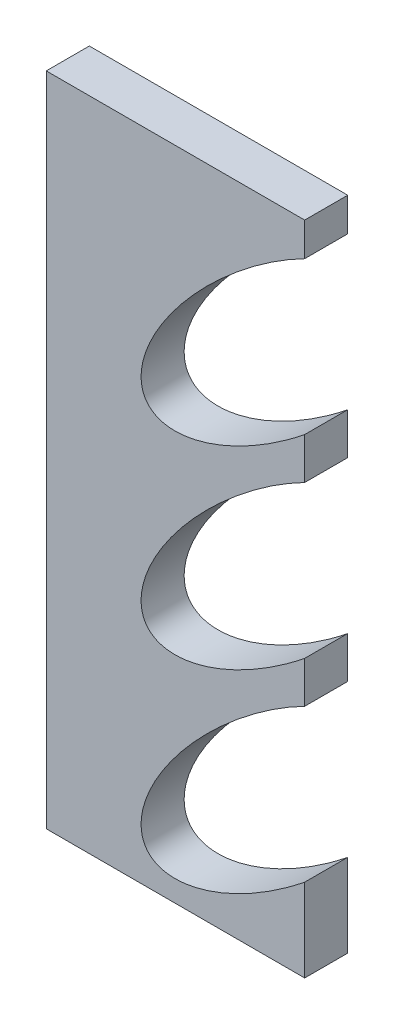
ISO-10303-21;
HEADER;
FILE_DESCRIPTION(('STEP AP214'),'2;1');
FILE_NAME('part.step','',(''),(''),'','','');
FILE_SCHEMA(('AUTOMOTIVE_DESIGN { 1 0 10303 214 1 1 1 1 }'));
ENDSEC;
DATA;
#1=APPLICATION_CONTEXT('core data for automotive mechanical design processes');
#2=APPLICATION_PROTOCOL_DEFINITION('international standard','automotive_design',2000,#1);
#3=PRODUCT_CONTEXT('',#1,'mechanical');
#4=PRODUCT('Part','Part','',(#3));
#5=PRODUCT_RELATED_PRODUCT_CATEGORY('part','',(#4));
#6=PRODUCT_DEFINITION_FORMATION('','',#4);
#7=PRODUCT_DEFINITION_CONTEXT('part definition',#1,'design');
#8=PRODUCT_DEFINITION('design','',#6,#7);
#9=PRODUCT_DEFINITION_SHAPE('','',#8);
#10=(LENGTH_UNIT() NAMED_UNIT(*) SI_UNIT(.MILLI.,.METRE.));
#11=(NAMED_UNIT(*) PLANE_ANGLE_UNIT() SI_UNIT($,.RADIAN.));
#12=(NAMED_UNIT(*) SI_UNIT($,.STERADIAN.) SOLID_ANGLE_UNIT());
#13=UNCERTAINTY_MEASURE_WITH_UNIT(LENGTH_MEASURE(1.E-05),#10,'distance_accuracy_value','');
#14=(GEOMETRIC_REPRESENTATION_CONTEXT(3) GLOBAL_UNCERTAINTY_ASSIGNED_CONTEXT((#13)) GLOBAL_UNIT_ASSIGNED_CONTEXT((#10,
#11,#12)) REPRESENTATION_CONTEXT('',''));
#15=CARTESIAN_POINT('',(0.,0.,0.));
#16=DIRECTION('',(0.,0.,1.));
#17=DIRECTION('',(1.,0.,0.));
#18=AXIS2_PLACEMENT_3D('',#15,#16,#17);
#19=CARTESIAN_POINT('',(11.560233287585,-74.854986086369,10.));
#20=DIRECTION('',(0.,0.,1.));
#21=DIRECTION('',(0.761644612027726,0.647994972950513,0.));
#22=AXIS2_PLACEMENT_3D('',#19,#20,#21);
#23=ELLIPSE('',#22,38.2784229302773,14.5789494724015);
#24=DIRECTION('',(0.,0.,-1.));
#25=VECTOR('',#24,1.);
#26=SURFACE_OF_LINEAR_EXTRUSION('',#23,#25);
#27=CARTESIAN_POINT('',(11.560233287585,-74.854986086369,0.));
#28=DIRECTION('',(0.,0.,1.));
#29=DIRECTION('',(0.761644612027726,0.647994972950513,0.));
#30=AXIS2_PLACEMENT_3D('',#27,#28,#29);
#31=ELLIPSE('',#30,38.2784229302773,14.5789494724015);
#32=CARTESIAN_POINT('',(18.897322572362,-52.3455624513533,0.));
#33=VERTEX_POINT('',#32);
#34=CARTESIAN_POINT('',(18.897322572362,-87.7050667853162,0.));
#35=VERTEX_POINT('',#34);
#36=EDGE_CURVE('E147',#33,#35,#31,.T.);
#37=ORIENTED_EDGE('',*,*,#36,.F.);
#38=DIRECTION('',(0.,0.,-1.));
#39=VECTOR('',#38,1.);
#40=CARTESIAN_POINT('',(18.897322572362,-52.3455624513533,10.));
#41=LINE('',#40,#39);
#42=CARTESIAN_POINT('',(18.897322572362,-52.3455624513533,10.));
#43=VERTEX_POINT('',#42);
#44=EDGE_CURVE('E11',#43,#33,#41,.T.);
#45=ORIENTED_EDGE('',*,*,#44,.F.);
#46=CARTESIAN_POINT('',(18.897322572362,-87.7050667853162,10.));
#47=VERTEX_POINT('',#46);
#48=EDGE_CURVE('E197',#43,#47,#23,.T.);
#49=ORIENTED_EDGE('',*,*,#48,.T.);
#50=DIRECTION('',(0.,0.,-1.));
#51=VECTOR('',#50,1.);
#52=CARTESIAN_POINT('',(18.897322572362,-87.7050667853162,10.));
#53=LINE('',#52,#51);
#54=EDGE_CURVE('E56',#47,#35,#53,.T.);
#55=ORIENTED_EDGE('',*,*,#54,.T.);
#56=EDGE_LOOP('',(#37,#45,#49,#55));
#57=FACE_BOUND('',#56,.T.);
#58=ADVANCED_FACE('F39',(#57),#26,.T.);
#59=CARTESIAN_POINT('',(18.8973225723619,0.,10.));
#60=DIRECTION('',(1.,0.,0.));
#61=DIRECTION('',(0.,1.,0.));
#62=AXIS2_PLACEMENT_3D('',#59,#60,#61);
#63=PLANE('',#62);
#64=DIRECTION('',(0.,-1.,0.));
#65=VECTOR('',#64,1.);
#66=CARTESIAN_POINT('',(18.8973225723619,0.,0.));
#67=LINE('',#66,#65);
#68=CARTESIAN_POINT('',(18.897322572362,-42.7050667853159,0.));
#69=VERTEX_POINT('',#68);
#70=EDGE_CURVE('E149',#69,#33,#67,.T.);
#71=ORIENTED_EDGE('',*,*,#70,.F.);
#72=DIRECTION('',(0.,0.,-1.));
#73=VECTOR('',#72,1.);
#74=CARTESIAN_POINT('',(18.897322572362,-42.7050667853159,10.));
#75=LINE('',#74,#73);
#76=CARTESIAN_POINT('',(18.897322572362,-42.7050667853159,10.));
#77=VERTEX_POINT('',#76);
#78=EDGE_CURVE('E48',#77,#69,#75,.T.);
#79=ORIENTED_EDGE('',*,*,#78,.F.);
#80=DIRECTION('',(0.,-1.,0.));
#81=VECTOR('',#80,1.);
#82=CARTESIAN_POINT('',(18.8973225723619,0.,10.));
#83=LINE('',#82,#81);
#84=EDGE_CURVE('E144',#77,#43,#83,.T.);
#85=ORIENTED_EDGE('',*,*,#84,.T.);
#86=ORIENTED_EDGE('',*,*,#44,.T.);
#87=EDGE_LOOP('',(#71,#79,#85,#86));
#88=FACE_BOUND('',#87,.T.);
#89=ADVANCED_FACE('F188',(#88),#63,.T.);
#90=CARTESIAN_POINT('',(11.5602332875845,-29.854986086369,10.));
#91=DIRECTION('',(0.,0.,1.));
#92=DIRECTION('',(0.761644612027725,0.647994972950513,0.));
#93=AXIS2_PLACEMENT_3D('',#90,#91,#92);
#94=ELLIPSE('',#93,38.2784229302773,14.5789494724015);
#95=DIRECTION('',(0.,0.,-1.));
#96=VECTOR('',#95,1.);
#97=SURFACE_OF_LINEAR_EXTRUSION('',#94,#96);
#98=CARTESIAN_POINT('',(11.5602332875845,-29.854986086369,0.));
#99=DIRECTION('',(0.,0.,1.));
#100=DIRECTION('',(0.761644612027725,0.647994972950513,0.));
#101=AXIS2_PLACEMENT_3D('',#98,#99,#100);
#102=ELLIPSE('',#101,38.2784229302773,14.5789494724015);
#103=CARTESIAN_POINT('',(18.8973225723619,-7.3455624513531,0.));
#104=VERTEX_POINT('',#103);
#105=EDGE_CURVE('E152',#104,#69,#102,.T.);
#106=ORIENTED_EDGE('',*,*,#105,.F.);
#107=DIRECTION('',(0.,0.,-1.));
#108=VECTOR('',#107,1.);
#109=CARTESIAN_POINT('',(18.8973225723619,-7.3455624513531,10.));
#110=LINE('',#109,#108);
#111=CARTESIAN_POINT('',(18.8973225723619,-7.3455624513531,10.));
#112=VERTEX_POINT('',#111);
#113=EDGE_CURVE('E176',#112,#104,#110,.T.);
#114=ORIENTED_EDGE('',*,*,#113,.F.);
#115=EDGE_CURVE('E184',#112,#77,#94,.T.);
#116=ORIENTED_EDGE('',*,*,#115,.T.);
#117=ORIENTED_EDGE('',*,*,#78,.T.);
#118=EDGE_LOOP('',(#106,#114,#116,#117));
#119=FACE_BOUND('',#118,.T.);
#120=ADVANCED_FACE('F181',(#119),#97,.T.);
#121=CARTESIAN_POINT('',(18.8973225723619,2.29493321468446,0.));
#122=VERTEX_POINT('',#121);
#123=EDGE_CURVE('E154',#122,#104,#67,.T.);
#124=ORIENTED_EDGE('',*,*,#123,.F.);
#125=DIRECTION('',(0.,0.,-1.));
#126=VECTOR('',#125,1.);
#127=CARTESIAN_POINT('',(18.8973225723619,2.29493321468446,10.));
#128=LINE('',#127,#126);
#129=CARTESIAN_POINT('',(18.8973225723619,2.29493321468446,10.));
#130=VERTEX_POINT('',#129);
#131=EDGE_CURVE('E174',#130,#122,#128,.T.);
#132=ORIENTED_EDGE('',*,*,#131,.F.);
#133=EDGE_CURVE('E198',#130,#112,#83,.T.);
#134=ORIENTED_EDGE('',*,*,#133,.T.);
#135=ORIENTED_EDGE('',*,*,#113,.T.);
#136=EDGE_LOOP('',(#124,#132,#134,#135));
#137=FACE_BOUND('',#136,.T.);
#138=ADVANCED_FACE('F207',(#137),#63,.T.);
#139=CARTESIAN_POINT('',(11.5602332875841,15.145013913631,10.));
#140=DIRECTION('',(0.,0.,1.));
#141=DIRECTION('',(0.761644612027725,0.647994972950513,0.));
#142=AXIS2_PLACEMENT_3D('',#139,#140,#141);
#143=ELLIPSE('',#142,38.2784229302773,14.5789494724015);
#144=DIRECTION('',(0.,0.,-1.));
#145=VECTOR('',#144,1.);
#146=SURFACE_OF_LINEAR_EXTRUSION('',#143,#145);
#147=CARTESIAN_POINT('',(11.5602332875841,15.145013913631,0.));
#148=DIRECTION('',(0.,0.,1.));
#149=DIRECTION('',(0.761644612027725,0.647994972950513,0.));
#150=AXIS2_PLACEMENT_3D('',#147,#148,#149);
#151=ELLIPSE('',#150,38.2784229302773,14.5789494724015);
#152=CARTESIAN_POINT('',(18.8973225723619,37.6544375486471,0.));
#153=VERTEX_POINT('',#152);
#154=EDGE_CURVE('E157',#153,#122,#151,.T.);
#155=ORIENTED_EDGE('',*,*,#154,.F.);
#156=DIRECTION('',(0.,0.,-1.));
#157=VECTOR('',#156,1.);
#158=CARTESIAN_POINT('',(18.8973225723619,37.6544375486471,10.));
#159=LINE('',#158,#157);
#160=CARTESIAN_POINT('',(18.8973225723619,37.6544375486471,10.));
#161=VERTEX_POINT('',#160);
#162=EDGE_CURVE('E172',#161,#153,#159,.T.);
#163=ORIENTED_EDGE('',*,*,#162,.F.);
#164=EDGE_CURVE('E203',#161,#130,#143,.T.);
#165=ORIENTED_EDGE('',*,*,#164,.T.);
#166=ORIENTED_EDGE('',*,*,#131,.T.);
#167=EDGE_LOOP('',(#155,#163,#165,#166));
#168=FACE_BOUND('',#167,.T.);
#169=ADVANCED_FACE('F208',(#168),#146,.T.);
#170=CARTESIAN_POINT('',(18.8973225723619,45.4229313514575,0.));
#171=VERTEX_POINT('',#170);
#172=EDGE_CURVE('E160',#171,#153,#67,.T.);
#173=ORIENTED_EDGE('',*,*,#172,.F.);
#174=DIRECTION('',(0.,0.,-1.));
#175=VECTOR('',#174,1.);
#176=CARTESIAN_POINT('',(18.8973225723619,45.4229313514575,10.));
#177=LINE('',#176,#175);
#178=CARTESIAN_POINT('',(18.8973225723619,45.4229313514575,10.));
#179=VERTEX_POINT('',#178);
#180=EDGE_CURVE('E170',#179,#171,#177,.T.);
#181=ORIENTED_EDGE('',*,*,#180,.F.);
#182=EDGE_CURVE('E143',#179,#161,#83,.T.);
#183=ORIENTED_EDGE('',*,*,#182,.T.);
#184=ORIENTED_EDGE('',*,*,#162,.T.);
#185=EDGE_LOOP('',(#173,#181,#183,#184));
#186=FACE_BOUND('',#185,.T.);
#187=ADVANCED_FACE('F211',(#186),#63,.T.);
#188=CARTESIAN_POINT('',(0.,45.4229313514575,10.));
#189=DIRECTION('',(0.,1.,0.));
#190=DIRECTION('',(0.,0.,1.));
#191=AXIS2_PLACEMENT_3D('',#188,#189,#190);
#192=PLANE('',#191);
#193=DIRECTION('',(1.,0.,0.));
#194=VECTOR('',#193,1.);
#195=CARTESIAN_POINT('',(0.,45.4229313514575,0.));
#196=LINE('',#195,#194);
#197=CARTESIAN_POINT('',(-41.1026774276381,45.4229313514575,0.));
#198=VERTEX_POINT('',#197);
#199=EDGE_CURVE('E161',#198,#171,#196,.T.);
#200=ORIENTED_EDGE('',*,*,#199,.F.);
#201=DIRECTION('',(0.,0.,-1.));
#202=VECTOR('',#201,1.);
#203=CARTESIAN_POINT('',(-41.1026774276381,45.4229313514575,10.));
#204=LINE('',#203,#202);
#205=CARTESIAN_POINT('',(-41.1026774276381,45.4229313514575,10.));
#206=VERTEX_POINT('',#205);
#207=EDGE_CURVE('E137',#206,#198,#204,.T.);
#208=ORIENTED_EDGE('',*,*,#207,.F.);
#209=DIRECTION('',(1.,0.,0.));
#210=VECTOR('',#209,1.);
#211=CARTESIAN_POINT('',(0.,45.4229313514575,10.));
#212=LINE('',#211,#210);
#213=EDGE_CURVE('E127',#206,#179,#212,.T.);
#214=ORIENTED_EDGE('',*,*,#213,.T.);
#215=ORIENTED_EDGE('',*,*,#180,.T.);
#216=EDGE_LOOP('',(#200,#208,#214,#215));
#217=FACE_BOUND('',#216,.T.);
#218=ADVANCED_FACE('F213',(#217),#192,.T.);
#219=CARTESIAN_POINT('',(-41.1026774276381,0.,10.));
#220=DIRECTION('',(1.,0.,0.));
#221=DIRECTION('',(0.,1.,0.));
#222=AXIS2_PLACEMENT_3D('',#219,#220,#221);
#223=PLANE('',#222);
#224=DIRECTION('',(0.,-1.,0.));
#225=VECTOR('',#224,1.);
#226=CARTESIAN_POINT('',(-41.1026774276381,0.,0.));
#227=LINE('',#226,#225);
#228=CARTESIAN_POINT('',(-41.102677427638,-106.977068648542,0.));
#229=VERTEX_POINT('',#228);
#230=EDGE_CURVE('E134',#198,#229,#227,.T.);
#231=ORIENTED_EDGE('',*,*,#230,.T.);
#232=DIRECTION('',(0.,0.,-1.));
#233=VECTOR('',#232,1.);
#234=CARTESIAN_POINT('',(-41.102677427638,-106.977068648542,10.));
#235=LINE('',#234,#233);
#236=CARTESIAN_POINT('',(-41.102677427638,-106.977068648542,10.));
#237=VERTEX_POINT('',#236);
#238=EDGE_CURVE('E131',#237,#229,#235,.T.);
#239=ORIENTED_EDGE('',*,*,#238,.F.);
#240=DIRECTION('',(0.,-1.,0.));
#241=VECTOR('',#240,1.);
#242=CARTESIAN_POINT('',(-41.1026774276381,0.,10.));
#243=LINE('',#242,#241);
#244=EDGE_CURVE('E119',#206,#237,#243,.T.);
#245=ORIENTED_EDGE('',*,*,#244,.F.);
#246=ORIENTED_EDGE('',*,*,#207,.T.);
#247=EDGE_LOOP('',(#231,#239,#245,#246));
#248=FACE_BOUND('',#247,.T.);
#249=ADVANCED_FACE('F132',(#248),#223,.F.);
#250=CARTESIAN_POINT('',(0.,-106.977068648542,10.));
#251=DIRECTION('',(0.,1.,0.));
#252=DIRECTION('',(0.,0.,1.));
#253=AXIS2_PLACEMENT_3D('',#250,#251,#252);
#254=PLANE('',#253);
#255=DIRECTION('',(1.,0.,0.));
#256=VECTOR('',#255,1.);
#257=CARTESIAN_POINT('',(0.,-106.977068648542,0.));
#258=LINE('',#257,#256);
#259=CARTESIAN_POINT('',(18.897322572362,-106.977068648542,0.));
#260=VERTEX_POINT('',#259);
#261=EDGE_CURVE('E165',#229,#260,#258,.T.);
#262=ORIENTED_EDGE('',*,*,#261,.T.);
#263=DIRECTION('',(0.,0.,-1.));
#264=VECTOR('',#263,1.);
#265=CARTESIAN_POINT('',(18.897322572362,-106.977068648542,10.));
#266=LINE('',#265,#264);
#267=CARTESIAN_POINT('',(18.897322572362,-106.977068648542,10.));
#268=VERTEX_POINT('',#267);
#269=EDGE_CURVE('E88',#268,#260,#266,.T.);
#270=ORIENTED_EDGE('',*,*,#269,.F.);
#271=DIRECTION('',(1.,0.,0.));
#272=VECTOR('',#271,1.);
#273=CARTESIAN_POINT('',(0.,-106.977068648542,10.));
#274=LINE('',#273,#272);
#275=EDGE_CURVE('E124',#237,#268,#274,.T.);
#276=ORIENTED_EDGE('',*,*,#275,.F.);
#277=ORIENTED_EDGE('',*,*,#238,.T.);
#278=EDGE_LOOP('',(#262,#270,#276,#277));
#279=FACE_BOUND('',#278,.T.);
#280=ADVANCED_FACE('F139',(#279),#254,.F.);
#281=EDGE_CURVE('E153',#35,#260,#67,.T.);
#282=ORIENTED_EDGE('',*,*,#281,.F.);
#283=ORIENTED_EDGE('',*,*,#54,.F.);
#284=EDGE_CURVE('E140',#47,#268,#83,.T.);
#285=ORIENTED_EDGE('',*,*,#284,.T.);
#286=ORIENTED_EDGE('',*,*,#269,.T.);
#287=EDGE_LOOP('',(#282,#283,#285,#286));
#288=FACE_BOUND('',#287,.T.);
#289=ADVANCED_FACE('F221',(#288),#63,.T.);
#290=CARTESIAN_POINT('',(0.,0.,10.));
#291=DIRECTION('',(0.,0.,1.));
#292=DIRECTION('',(1.,0.,0.));
#293=AXIS2_PLACEMENT_3D('',#290,#291,#292);
#294=PLANE('',#293);
#295=ORIENTED_EDGE('',*,*,#48,.F.);
#296=ORIENTED_EDGE('',*,*,#84,.F.);
#297=ORIENTED_EDGE('',*,*,#115,.F.);
#298=ORIENTED_EDGE('',*,*,#133,.F.);
#299=ORIENTED_EDGE('',*,*,#164,.F.);
#300=ORIENTED_EDGE('',*,*,#182,.F.);
#301=ORIENTED_EDGE('',*,*,#213,.F.);
#302=ORIENTED_EDGE('',*,*,#244,.T.);
#303=ORIENTED_EDGE('',*,*,#275,.T.);
#304=ORIENTED_EDGE('',*,*,#284,.F.);
#305=EDGE_LOOP('',(#295,#296,#297,#298,#299,#300,#301,#302,#303,#304));
#306=FACE_BOUND('',#305,.T.);
#307=ADVANCED_FACE('F121',(#306),#294,.T.);
#308=CARTESIAN_POINT('',(0.,0.,0.));
#309=DIRECTION('',(0.,0.,1.));
#310=DIRECTION('',(1.,0.,0.));
#311=AXIS2_PLACEMENT_3D('',#308,#309,#310);
#312=PLANE('',#311);
#313=ORIENTED_EDGE('',*,*,#36,.T.);
#314=ORIENTED_EDGE('',*,*,#281,.T.);
#315=ORIENTED_EDGE('',*,*,#261,.F.);
#316=ORIENTED_EDGE('',*,*,#230,.F.);
#317=ORIENTED_EDGE('',*,*,#199,.T.);
#318=ORIENTED_EDGE('',*,*,#172,.T.);
#319=ORIENTED_EDGE('',*,*,#154,.T.);
#320=ORIENTED_EDGE('',*,*,#123,.T.);
#321=ORIENTED_EDGE('',*,*,#105,.T.);
#322=ORIENTED_EDGE('',*,*,#70,.T.);
#323=EDGE_LOOP('',(#313,#314,#315,#316,#317,#318,#319,#320,#321,#322));
#324=FACE_BOUND('',#323,.T.);
#325=ADVANCED_FACE('F190',(#324),#312,.F.);
#326=CLOSED_SHELL('',(#58,#89,#120,#138,#169,#187,#218,#249,#280,#289,#307,#325));
#327=MANIFOLD_SOLID_BREP('B2',#326);
#328=ADVANCED_BREP_SHAPE_REPRESENTATION('',(#18,#327),#14);
#329=SHAPE_DEFINITION_REPRESENTATION(#9,#328);
ENDSEC;
END-ISO-10303-21;
